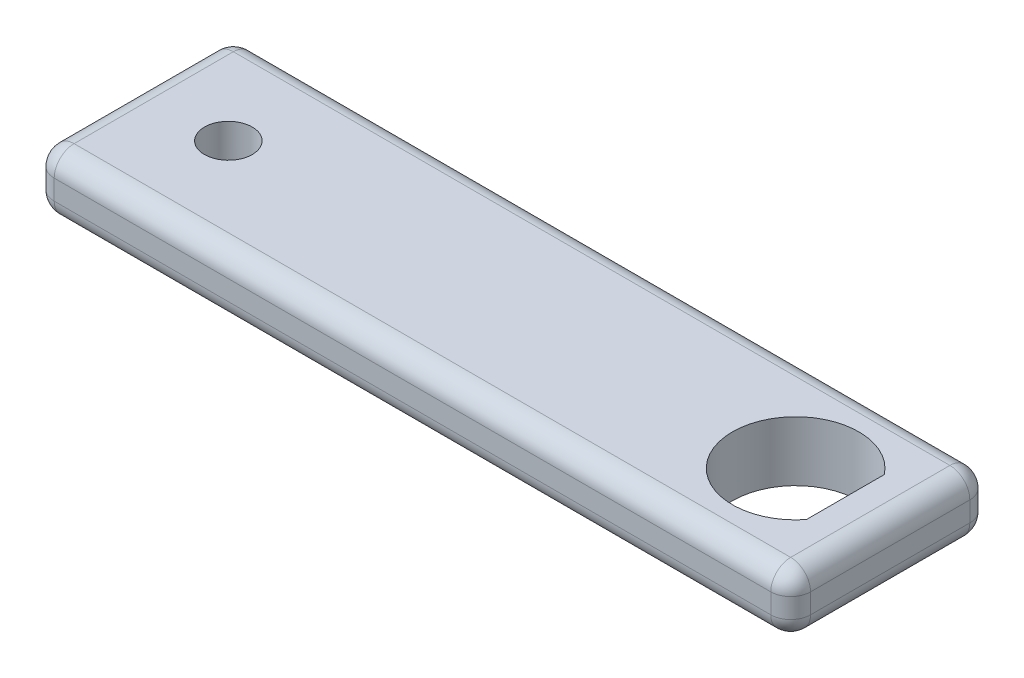
ISO-10303-21;
HEADER;
FILE_DESCRIPTION(('STEP AP214'),'2;1');
FILE_NAME('part.step','',(''),(''),'','','');
FILE_SCHEMA(('AUTOMOTIVE_DESIGN { 1 0 10303 214 1 1 1 1 }'));
ENDSEC;
DATA;
#1=APPLICATION_CONTEXT('core data for automotive mechanical design processes');
#2=APPLICATION_PROTOCOL_DEFINITION('international standard','automotive_design',2000,#1);
#3=PRODUCT_CONTEXT('',#1,'mechanical');
#4=PRODUCT('Part','Part','',(#3));
#5=PRODUCT_RELATED_PRODUCT_CATEGORY('part','',(#4));
#6=PRODUCT_DEFINITION_FORMATION('','',#4);
#7=PRODUCT_DEFINITION_CONTEXT('part definition',#1,'design');
#8=PRODUCT_DEFINITION('design','',#6,#7);
#9=PRODUCT_DEFINITION_SHAPE('','',#8);
#10=(LENGTH_UNIT() NAMED_UNIT(*) SI_UNIT(.MILLI.,.METRE.));
#11=(NAMED_UNIT(*) PLANE_ANGLE_UNIT() SI_UNIT($,.RADIAN.));
#12=(NAMED_UNIT(*) SI_UNIT($,.STERADIAN.) SOLID_ANGLE_UNIT());
#13=UNCERTAINTY_MEASURE_WITH_UNIT(LENGTH_MEASURE(1.E-05),#10,'distance_accuracy_value','');
#14=(GEOMETRIC_REPRESENTATION_CONTEXT(3) GLOBAL_UNCERTAINTY_ASSIGNED_CONTEXT((#13)) GLOBAL_UNIT_ASSIGNED_CONTEXT((#10,
#11,#12)) REPRESENTATION_CONTEXT('',''));
#15=CARTESIAN_POINT('',(0.,0.,0.));
#16=DIRECTION('',(0.,0.,1.));
#17=DIRECTION('',(1.,0.,0.));
#18=AXIS2_PLACEMENT_3D('',#15,#16,#17);
#19=CARTESIAN_POINT('',(0.,6.,0.));
#20=DIRECTION('',(1.,0.,0.));
#21=DIRECTION('',(0.,0.,-1.));
#22=AXIS2_PLACEMENT_3D('',#19,#20,#21);
#23=PLANE('',#22);
#24=DIRECTION('',(0.,-1.,0.));
#25=VECTOR('',#24,1.);
#26=CARTESIAN_POINT('',(0.,6.,-18.));
#27=LINE('',#26,#25);
#28=CARTESIAN_POINT('',(0.,4.,-18.));
#29=VERTEX_POINT('',#28);
#30=CARTESIAN_POINT('',(0.,2.,-18.));
#31=VERTEX_POINT('',#30);
#32=EDGE_CURVE('E172',#29,#31,#27,.T.);
#33=ORIENTED_EDGE('',*,*,#32,.T.);
#34=DIRECTION('',(0.,0.,1.));
#35=VECTOR('',#34,1.);
#36=CARTESIAN_POINT('',(0.,2.,0.));
#37=LINE('',#36,#35);
#38=CARTESIAN_POINT('',(0.,2.,-2.));
#39=VERTEX_POINT('',#38);
#40=EDGE_CURVE('E175',#31,#39,#37,.T.);
#41=ORIENTED_EDGE('',*,*,#40,.T.);
#42=DIRECTION('',(0.,-1.,0.));
#43=VECTOR('',#42,1.);
#44=CARTESIAN_POINT('',(0.,6.,-2.));
#45=LINE('',#44,#43);
#46=CARTESIAN_POINT('',(0.,4.,-2.));
#47=VERTEX_POINT('',#46);
#48=EDGE_CURVE('E170',#39,#47,#45,.F.);
#49=ORIENTED_EDGE('',*,*,#48,.T.);
#50=DIRECTION('',(0.,0.,1.));
#51=VECTOR('',#50,1.);
#52=CARTESIAN_POINT('',(0.,4.,0.));
#53=LINE('',#52,#51);
#54=EDGE_CURVE('E168',#47,#29,#53,.F.);
#55=ORIENTED_EDGE('',*,*,#54,.T.);
#56=EDGE_LOOP('',(#33,#41,#49,#55));
#57=FACE_BOUND('',#56,.T.);
#58=ADVANCED_FACE('F33',(#57),#23,.F.);
#59=CARTESIAN_POINT('',(0.,6.,0.));
#60=DIRECTION('',(0.,0.,-1.));
#61=DIRECTION('',(-1.,0.,0.));
#62=AXIS2_PLACEMENT_3D('',#59,#60,#61);
#63=PLANE('',#62);
#64=DIRECTION('',(0.,-1.,0.));
#65=VECTOR('',#64,1.);
#66=CARTESIAN_POINT('',(2.,6.,0.));
#67=LINE('',#66,#65);
#68=CARTESIAN_POINT('',(2.,4.,0.));
#69=VERTEX_POINT('',#68);
#70=CARTESIAN_POINT('',(2.,2.,0.));
#71=VERTEX_POINT('',#70);
#72=EDGE_CURVE('E190',#69,#71,#67,.T.);
#73=ORIENTED_EDGE('',*,*,#72,.T.);
#74=DIRECTION('',(1.,0.,0.));
#75=VECTOR('',#74,1.);
#76=CARTESIAN_POINT('',(76.,2.,0.));
#77=LINE('',#76,#75);
#78=CARTESIAN_POINT('',(74.,2.,0.));
#79=VERTEX_POINT('',#78);
#80=EDGE_CURVE('E193',#71,#79,#77,.T.);
#81=ORIENTED_EDGE('',*,*,#80,.T.);
#82=DIRECTION('',(0.,-1.,0.));
#83=VECTOR('',#82,1.);
#84=CARTESIAN_POINT('',(74.,6.,0.));
#85=LINE('',#84,#83);
#86=CARTESIAN_POINT('',(74.,4.,0.));
#87=VERTEX_POINT('',#86);
#88=EDGE_CURVE('E188',#79,#87,#85,.F.);
#89=ORIENTED_EDGE('',*,*,#88,.T.);
#90=DIRECTION('',(1.,0.,0.));
#91=VECTOR('',#90,1.);
#92=CARTESIAN_POINT('',(0.,4.,0.));
#93=LINE('',#92,#91);
#94=EDGE_CURVE('E186',#87,#69,#93,.F.);
#95=ORIENTED_EDGE('',*,*,#94,.T.);
#96=EDGE_LOOP('',(#73,#81,#89,#95));
#97=FACE_BOUND('',#96,.T.);
#98=ADVANCED_FACE('F305',(#97),#63,.F.);
#99=CARTESIAN_POINT('',(76.,6.,0.));
#100=DIRECTION('',(-1.,0.,0.));
#101=DIRECTION('',(0.,0.,1.));
#102=AXIS2_PLACEMENT_3D('',#99,#100,#101);
#103=PLANE('',#102);
#104=DIRECTION('',(0.,-1.,0.));
#105=VECTOR('',#104,1.);
#106=CARTESIAN_POINT('',(76.,6.,-2.));
#107=LINE('',#106,#105);
#108=CARTESIAN_POINT('',(76.,4.,-2.));
#109=VERTEX_POINT('',#108);
#110=CARTESIAN_POINT('',(76.,2.,-2.));
#111=VERTEX_POINT('',#110);
#112=EDGE_CURVE('E197',#109,#111,#107,.T.);
#113=ORIENTED_EDGE('',*,*,#112,.T.);
#114=DIRECTION('',(0.,0.,-1.));
#115=VECTOR('',#114,1.);
#116=CARTESIAN_POINT('',(76.,2.,-20.));
#117=LINE('',#116,#115);
#118=CARTESIAN_POINT('',(76.,2.,-18.));
#119=VERTEX_POINT('',#118);
#120=EDGE_CURVE('E202',#111,#119,#117,.T.);
#121=ORIENTED_EDGE('',*,*,#120,.T.);
#122=DIRECTION('',(0.,-1.,0.));
#123=VECTOR('',#122,1.);
#124=CARTESIAN_POINT('',(76.,6.,-18.));
#125=LINE('',#124,#123);
#126=CARTESIAN_POINT('',(76.,4.,-18.));
#127=VERTEX_POINT('',#126);
#128=EDGE_CURVE('E199',#119,#127,#125,.F.);
#129=ORIENTED_EDGE('',*,*,#128,.T.);
#130=DIRECTION('',(0.,0.,-1.));
#131=VECTOR('',#130,1.);
#132=CARTESIAN_POINT('',(76.,4.,0.));
#133=LINE('',#132,#131);
#134=EDGE_CURVE('E195',#127,#109,#133,.F.);
#135=ORIENTED_EDGE('',*,*,#134,.T.);
#136=EDGE_LOOP('',(#113,#121,#129,#135));
#137=FACE_BOUND('',#136,.T.);
#138=ADVANCED_FACE('F311',(#137),#103,.F.);
#139=CARTESIAN_POINT('',(0.,6.,-20.));
#140=DIRECTION('',(0.,0.,1.));
#141=DIRECTION('',(1.,0.,0.));
#142=AXIS2_PLACEMENT_3D('',#139,#140,#141);
#143=PLANE('',#142);
#144=DIRECTION('',(0.,-1.,0.));
#145=VECTOR('',#144,1.);
#146=CARTESIAN_POINT('',(74.,6.,-20.));
#147=LINE('',#146,#145);
#148=CARTESIAN_POINT('',(74.,4.,-20.));
#149=VERTEX_POINT('',#148);
#150=CARTESIAN_POINT('',(74.,2.,-20.));
#151=VERTEX_POINT('',#150);
#152=EDGE_CURVE('E179',#149,#151,#147,.T.);
#153=ORIENTED_EDGE('',*,*,#152,.T.);
#154=DIRECTION('',(-1.,0.,0.));
#155=VECTOR('',#154,1.);
#156=CARTESIAN_POINT('',(0.,2.,-20.));
#157=LINE('',#156,#155);
#158=CARTESIAN_POINT('',(2.,2.,-20.));
#159=VERTEX_POINT('',#158);
#160=EDGE_CURVE('E184',#151,#159,#157,.T.);
#161=ORIENTED_EDGE('',*,*,#160,.T.);
#162=DIRECTION('',(0.,-1.,0.));
#163=VECTOR('',#162,1.);
#164=CARTESIAN_POINT('',(2.,6.,-20.));
#165=LINE('',#164,#163);
#166=CARTESIAN_POINT('',(2.,4.,-20.));
#167=VERTEX_POINT('',#166);
#168=EDGE_CURVE('E181',#159,#167,#165,.F.);
#169=ORIENTED_EDGE('',*,*,#168,.T.);
#170=DIRECTION('',(-1.,0.,0.));
#171=VECTOR('',#170,1.);
#172=CARTESIAN_POINT('',(0.,4.,-20.));
#173=LINE('',#172,#171);
#174=EDGE_CURVE('E177',#167,#149,#173,.F.);
#175=ORIENTED_EDGE('',*,*,#174,.T.);
#176=EDGE_LOOP('',(#153,#161,#169,#175));
#177=FACE_BOUND('',#176,.T.);
#178=ADVANCED_FACE('F289',(#177),#143,.F.);
#179=CARTESIAN_POINT('',(0.,6.,0.));
#180=DIRECTION('',(0.,-1.,0.));
#181=DIRECTION('',(0.,0.,-1.));
#182=AXIS2_PLACEMENT_3D('',#179,#180,#181);
#183=PLANE('',#182);
#184=DIRECTION('',(-1.,0.,0.));
#185=VECTOR('',#184,1.);
#186=CARTESIAN_POINT('',(0.,6.,-18.));
#187=LINE('',#186,#185);
#188=CARTESIAN_POINT('',(74.,6.,-18.));
#189=VERTEX_POINT('',#188);
#190=CARTESIAN_POINT('',(2.,6.,-18.));
#191=VERTEX_POINT('',#190);
#192=EDGE_CURVE('E213',#189,#191,#187,.T.);
#193=ORIENTED_EDGE('',*,*,#192,.T.);
#194=DIRECTION('',(0.,0.,1.));
#195=VECTOR('',#194,1.);
#196=CARTESIAN_POINT('',(2.,6.,0.));
#197=LINE('',#196,#195);
#198=CARTESIAN_POINT('',(2.,6.,-2.));
#199=VERTEX_POINT('',#198);
#200=EDGE_CURVE('E11',#191,#199,#197,.T.);
#201=ORIENTED_EDGE('',*,*,#200,.T.);
#202=DIRECTION('',(1.,0.,0.));
#203=VECTOR('',#202,1.);
#204=CARTESIAN_POINT('',(0.,6.,-2.));
#205=LINE('',#204,#203);
#206=CARTESIAN_POINT('',(74.,6.,-2.));
#207=VERTEX_POINT('',#206);
#208=EDGE_CURVE('E42',#199,#207,#205,.T.);
#209=ORIENTED_EDGE('',*,*,#208,.T.);
#210=DIRECTION('',(0.,0.,-1.));
#211=VECTOR('',#210,1.);
#212=CARTESIAN_POINT('',(74.,6.,0.));
#213=LINE('',#212,#211);
#214=EDGE_CURVE('E215',#207,#189,#213,.T.);
#215=ORIENTED_EDGE('',*,*,#214,.T.);
#216=EDGE_LOOP('',(#193,#201,#209,#215));
#217=FACE_BOUND('',#216,.T.);
#218=CARTESIAN_POINT('',(66.5,6.,-10.));
#219=DIRECTION('',(0.,1.,0.));
#220=DIRECTION('',(0.,0.,1.));
#221=AXIS2_PLACEMENT_3D('',#218,#219,#220);
#222=CIRCLE('',#221,6.35);
#223=CARTESIAN_POINT('',(71.5,6.,-13.91439650521));
#224=VERTEX_POINT('',#223);
#225=CARTESIAN_POINT('',(71.5,6.,-6.08560349479005));
#226=VERTEX_POINT('',#225);
#227=EDGE_CURVE('E157',#224,#226,#222,.T.);
#228=ORIENTED_EDGE('',*,*,#227,.F.);
#229=DIRECTION('',(0.,0.,-1.));
#230=VECTOR('',#229,1.);
#231=CARTESIAN_POINT('',(71.5,6.,-13.91439650521));
#232=LINE('',#231,#230);
#233=EDGE_CURVE('E152',#226,#224,#232,.T.);
#234=ORIENTED_EDGE('',*,*,#233,.F.);
#235=EDGE_LOOP('',(#228,#234));
#236=FACE_BOUND('',#235,.T.);
#237=CARTESIAN_POINT('',(9.5,6.,-10.));
#238=DIRECTION('',(0.,1.,0.));
#239=DIRECTION('',(0.,0.,1.));
#240=AXIS2_PLACEMENT_3D('',#237,#238,#239);
#241=CIRCLE('',#240,2.4);
#242=CARTESIAN_POINT('',(9.5,6.,-7.6));
#243=VERTEX_POINT('',#242);
#244=EDGE_CURVE('E162',#243,#243,#241,.T.);
#245=ORIENTED_EDGE('',*,*,#244,.F.);
#246=EDGE_LOOP('',(#245));
#247=FACE_BOUND('',#246,.T.);
#248=ADVANCED_FACE('F286',(#217,#236,#247),#183,.F.);
#249=CARTESIAN_POINT('',(0.,0.,0.));
#250=DIRECTION('',(0.,-1.,0.));
#251=DIRECTION('',(0.,0.,-1.));
#252=AXIS2_PLACEMENT_3D('',#249,#250,#251);
#253=PLANE('',#252);
#254=DIRECTION('',(1.,0.,0.));
#255=VECTOR('',#254,1.);
#256=CARTESIAN_POINT('',(0.,0.,-2.));
#257=LINE('',#256,#255);
#258=CARTESIAN_POINT('',(74.,0.,-2.));
#259=VERTEX_POINT('',#258);
#260=CARTESIAN_POINT('',(2.,0.,-2.));
#261=VERTEX_POINT('',#260);
#262=EDGE_CURVE('E204',#259,#261,#257,.F.);
#263=ORIENTED_EDGE('',*,*,#262,.T.);
#264=DIRECTION('',(0.,0.,1.));
#265=VECTOR('',#264,1.);
#266=CARTESIAN_POINT('',(2.,0.,-20.));
#267=LINE('',#266,#265);
#268=CARTESIAN_POINT('',(2.,0.,-18.));
#269=VERTEX_POINT('',#268);
#270=EDGE_CURVE('E210',#261,#269,#267,.F.);
#271=ORIENTED_EDGE('',*,*,#270,.T.);
#272=DIRECTION('',(-1.,0.,0.));
#273=VECTOR('',#272,1.);
#274=CARTESIAN_POINT('',(76.,0.,-18.));
#275=LINE('',#274,#273);
#276=CARTESIAN_POINT('',(74.,0.,-18.));
#277=VERTEX_POINT('',#276);
#278=EDGE_CURVE('E208',#269,#277,#275,.F.);
#279=ORIENTED_EDGE('',*,*,#278,.T.);
#280=DIRECTION('',(0.,0.,-1.));
#281=VECTOR('',#280,1.);
#282=CARTESIAN_POINT('',(74.,0.,0.));
#283=LINE('',#282,#281);
#284=EDGE_CURVE('E206',#277,#259,#283,.F.);
#285=ORIENTED_EDGE('',*,*,#284,.T.);
#286=EDGE_LOOP('',(#263,#271,#279,#285));
#287=FACE_BOUND('',#286,.T.);
#288=DIRECTION('',(0.,0.,-1.));
#289=VECTOR('',#288,1.);
#290=CARTESIAN_POINT('',(71.5,0.,-13.91439650521));
#291=LINE('',#290,#289);
#292=CARTESIAN_POINT('',(71.5,0.,-6.08560349479005));
#293=VERTEX_POINT('',#292);
#294=CARTESIAN_POINT('',(71.5,0.,-13.91439650521));
#295=VERTEX_POINT('',#294);
#296=EDGE_CURVE('E150',#293,#295,#291,.T.);
#297=ORIENTED_EDGE('',*,*,#296,.T.);
#298=CARTESIAN_POINT('',(66.5,0.,-10.));
#299=DIRECTION('',(0.,-1.,0.));
#300=DIRECTION('',(0.,0.,-1.));
#301=AXIS2_PLACEMENT_3D('',#298,#299,#300);
#302=CIRCLE('',#301,6.35);
#303=EDGE_CURVE('E137',#295,#293,#302,.F.);
#304=ORIENTED_EDGE('',*,*,#303,.T.);
#305=EDGE_LOOP('',(#297,#304));
#306=FACE_BOUND('',#305,.T.);
#307=CARTESIAN_POINT('',(9.5,0.,-10.));
#308=DIRECTION('',(0.,-1.,0.));
#309=DIRECTION('',(0.,0.,-1.));
#310=AXIS2_PLACEMENT_3D('',#307,#308,#309);
#311=CIRCLE('',#310,2.4);
#312=CARTESIAN_POINT('',(9.5,0.,-12.4));
#313=VERTEX_POINT('',#312);
#314=EDGE_CURVE('E165',#313,#313,#311,.F.);
#315=ORIENTED_EDGE('',*,*,#314,.T.);
#316=EDGE_LOOP('',(#315));
#317=FACE_BOUND('',#316,.T.);
#318=ADVANCED_FACE('F154',(#287,#306,#317),#253,.T.);
#319=CARTESIAN_POINT('',(9.5,-17.0326891593782,-10.));
#320=DIRECTION('',(0.,1.,0.));
#321=DIRECTION('',(0.,0.,1.));
#322=AXIS2_PLACEMENT_3D('',#319,#320,#321);
#323=CYLINDRICAL_SURFACE('',#322,2.4);
#324=ORIENTED_EDGE('',*,*,#244,.T.);
#325=EDGE_LOOP('',(#324));
#326=FACE_BOUND('',#325,.T.);
#327=ORIENTED_EDGE('',*,*,#314,.F.);
#328=EDGE_LOOP('',(#327));
#329=FACE_BOUND('',#328,.T.);
#330=ADVANCED_FACE('F293',(#326,#329),#323,.F.);
#331=CARTESIAN_POINT('',(71.5,-17.0326891593782,-13.91439650521));
#332=DIRECTION('',(1.,0.,0.));
#333=DIRECTION('',(0.,0.,-1.));
#334=AXIS2_PLACEMENT_3D('',#331,#332,#333);
#335=PLANE('',#334);
#336=DIRECTION('',(0.,1.,0.));
#337=VECTOR('',#336,1.);
#338=CARTESIAN_POINT('',(71.5,-17.0326891593782,-6.08560349479005));
#339=LINE('',#338,#337);
#340=EDGE_CURVE('E143',#293,#226,#339,.T.);
#341=ORIENTED_EDGE('',*,*,#340,.T.);
#342=ORIENTED_EDGE('',*,*,#233,.T.);
#343=DIRECTION('',(0.,1.,0.));
#344=VECTOR('',#343,1.);
#345=CARTESIAN_POINT('',(71.5,-17.0326891593782,-13.91439650521));
#346=LINE('',#345,#344);
#347=EDGE_CURVE('E141',#295,#224,#346,.T.);
#348=ORIENTED_EDGE('',*,*,#347,.F.);
#349=ORIENTED_EDGE('',*,*,#296,.F.);
#350=EDGE_LOOP('',(#341,#342,#348,#349));
#351=FACE_BOUND('',#350,.T.);
#352=ADVANCED_FACE('F149',(#351),#335,.F.);
#353=CARTESIAN_POINT('',(66.5,-17.0326891593782,-10.));
#354=DIRECTION('',(0.,1.,0.));
#355=DIRECTION('',(0.,0.,1.));
#356=AXIS2_PLACEMENT_3D('',#353,#354,#355);
#357=CYLINDRICAL_SURFACE('',#356,6.35);
#358=ORIENTED_EDGE('',*,*,#347,.T.);
#359=ORIENTED_EDGE('',*,*,#227,.T.);
#360=ORIENTED_EDGE('',*,*,#340,.F.);
#361=ORIENTED_EDGE('',*,*,#303,.F.);
#362=EDGE_LOOP('',(#358,#359,#360,#361));
#363=FACE_BOUND('',#362,.T.);
#364=ADVANCED_FACE('F139',(#363),#357,.F.);
#365=CARTESIAN_POINT('',(74.,6.,-2.));
#366=DIRECTION('',(0.,-1.,0.));
#367=DIRECTION('',(0.,0.,-1.));
#368=AXIS2_PLACEMENT_3D('',#365,#366,#367);
#369=CYLINDRICAL_SURFACE('',#368,2.);
#370=CARTESIAN_POINT('',(74.,4.,-2.));
#371=DIRECTION('',(0.,1.,0.));
#372=DIRECTION('',(0.,0.,1.));
#373=AXIS2_PLACEMENT_3D('',#370,#371,#372);
#374=CIRCLE('',#373,2.);
#375=EDGE_CURVE('E37',#87,#109,#374,.T.);
#376=ORIENTED_EDGE('',*,*,#375,.F.);
#377=ORIENTED_EDGE('',*,*,#88,.F.);
#378=CARTESIAN_POINT('',(74.,2.,-2.));
#379=DIRECTION('',(0.,-1.,0.));
#380=DIRECTION('',(0.,0.,-1.));
#381=AXIS2_PLACEMENT_3D('',#378,#379,#380);
#382=CIRCLE('',#381,2.);
#383=EDGE_CURVE('E274',#111,#79,#382,.T.);
#384=ORIENTED_EDGE('',*,*,#383,.F.);
#385=ORIENTED_EDGE('',*,*,#112,.F.);
#386=EDGE_LOOP('',(#376,#377,#384,#385));
#387=FACE_BOUND('',#386,.T.);
#388=ADVANCED_FACE('F35',(#387),#369,.T.);
#389=CARTESIAN_POINT('',(74.,4.,-2.));
#390=DIRECTION('',(0.,0.,1.));
#391=DIRECTION('',(1.,0.,0.));
#392=AXIS2_PLACEMENT_3D('',#389,#390,#391);
#393=SPHERICAL_SURFACE('',#392,2.);
#394=CARTESIAN_POINT('',(74.,4.,-2.));
#395=DIRECTION('',(1.,0.,0.));
#396=DIRECTION('',(0.,0.,-1.));
#397=AXIS2_PLACEMENT_3D('',#394,#395,#396);
#398=CIRCLE('',#397,2.);
#399=EDGE_CURVE('E270',#87,#207,#398,.F.);
#400=ORIENTED_EDGE('',*,*,#399,.F.);
#401=ORIENTED_EDGE('',*,*,#375,.T.);
#402=CARTESIAN_POINT('',(74.,4.,-2.));
#403=DIRECTION('',(0.,0.,1.));
#404=DIRECTION('',(1.,0.,0.));
#405=AXIS2_PLACEMENT_3D('',#402,#403,#404);
#406=CIRCLE('',#405,2.);
#407=EDGE_CURVE('E272',#207,#109,#406,.F.);
#408=ORIENTED_EDGE('',*,*,#407,.F.);
#409=EDGE_LOOP('',(#400,#401,#408));
#410=FACE_BOUND('',#409,.T.);
#411=ADVANCED_FACE('F385',(#410),#393,.T.);
#412=CARTESIAN_POINT('',(74.,2.,-2.));
#413=DIRECTION('',(0.,0.,1.));
#414=DIRECTION('',(1.,0.,0.));
#415=AXIS2_PLACEMENT_3D('',#412,#413,#414);
#416=SPHERICAL_SURFACE('',#415,2.);
#417=CARTESIAN_POINT('',(74.,2.,-2.));
#418=DIRECTION('',(0.,0.,1.));
#419=DIRECTION('',(1.,0.,0.));
#420=AXIS2_PLACEMENT_3D('',#417,#418,#419);
#421=CIRCLE('',#420,2.);
#422=EDGE_CURVE('E264',#111,#259,#421,.F.);
#423=ORIENTED_EDGE('',*,*,#422,.F.);
#424=ORIENTED_EDGE('',*,*,#383,.T.);
#425=CARTESIAN_POINT('',(74.,2.,-2.));
#426=DIRECTION('',(1.,0.,0.));
#427=DIRECTION('',(0.,0.,-1.));
#428=AXIS2_PLACEMENT_3D('',#425,#426,#427);
#429=CIRCLE('',#428,2.);
#430=EDGE_CURVE('E267',#259,#79,#429,.F.);
#431=ORIENTED_EDGE('',*,*,#430,.F.);
#432=EDGE_LOOP('',(#423,#424,#431));
#433=FACE_BOUND('',#432,.T.);
#434=ADVANCED_FACE('F382',(#433),#416,.T.);
#435=CARTESIAN_POINT('',(74.,4.,0.));
#436=DIRECTION('',(0.,0.,-1.));
#437=DIRECTION('',(-1.,0.,0.));
#438=AXIS2_PLACEMENT_3D('',#435,#436,#437);
#439=CYLINDRICAL_SURFACE('',#438,2.);
#440=ORIENTED_EDGE('',*,*,#407,.T.);
#441=ORIENTED_EDGE('',*,*,#134,.F.);
#442=CARTESIAN_POINT('',(74.,4.,-18.));
#443=DIRECTION('',(0.,0.,-1.));
#444=DIRECTION('',(-1.,0.,0.));
#445=AXIS2_PLACEMENT_3D('',#442,#443,#444);
#446=CIRCLE('',#445,2.);
#447=EDGE_CURVE('E259',#189,#127,#446,.T.);
#448=ORIENTED_EDGE('',*,*,#447,.F.);
#449=ORIENTED_EDGE('',*,*,#214,.F.);
#450=EDGE_LOOP('',(#440,#441,#448,#449));
#451=FACE_BOUND('',#450,.T.);
#452=ADVANCED_FACE('F378',(#451),#439,.T.);
#453=CARTESIAN_POINT('',(0.,4.,-2.));
#454=DIRECTION('',(1.,0.,0.));
#455=DIRECTION('',(0.,0.,-1.));
#456=AXIS2_PLACEMENT_3D('',#453,#454,#455);
#457=CYLINDRICAL_SURFACE('',#456,2.);
#458=ORIENTED_EDGE('',*,*,#399,.T.);
#459=ORIENTED_EDGE('',*,*,#208,.F.);
#460=CARTESIAN_POINT('',(2.,4.,-2.));
#461=DIRECTION('',(-1.,0.,0.));
#462=DIRECTION('',(0.,0.,1.));
#463=AXIS2_PLACEMENT_3D('',#460,#461,#462);
#464=CIRCLE('',#463,2.);
#465=EDGE_CURVE('E257',#69,#199,#464,.T.);
#466=ORIENTED_EDGE('',*,*,#465,.F.);
#467=ORIENTED_EDGE('',*,*,#94,.F.);
#468=EDGE_LOOP('',(#458,#459,#466,#467));
#469=FACE_BOUND('',#468,.T.);
#470=ADVANCED_FACE('F374',(#469),#457,.T.);
#471=CARTESIAN_POINT('',(2.,6.,-2.));
#472=DIRECTION('',(0.,-1.,0.));
#473=DIRECTION('',(0.,0.,-1.));
#474=AXIS2_PLACEMENT_3D('',#471,#472,#473);
#475=CYLINDRICAL_SURFACE('',#474,2.);
#476=CARTESIAN_POINT('',(2.,2.,-2.));
#477=DIRECTION('',(0.,-1.,0.));
#478=DIRECTION('',(0.,0.,-1.));
#479=AXIS2_PLACEMENT_3D('',#476,#477,#478);
#480=CIRCLE('',#479,2.);
#481=EDGE_CURVE('E251',#71,#39,#480,.T.);
#482=ORIENTED_EDGE('',*,*,#481,.F.);
#483=ORIENTED_EDGE('',*,*,#72,.F.);
#484=CARTESIAN_POINT('',(2.,4.,-2.));
#485=DIRECTION('',(0.,1.,0.));
#486=DIRECTION('',(0.,0.,1.));
#487=AXIS2_PLACEMENT_3D('',#484,#485,#486);
#488=CIRCLE('',#487,2.);
#489=EDGE_CURVE('E254',#47,#69,#488,.T.);
#490=ORIENTED_EDGE('',*,*,#489,.F.);
#491=ORIENTED_EDGE('',*,*,#48,.F.);
#492=EDGE_LOOP('',(#482,#483,#490,#491));
#493=FACE_BOUND('',#492,.T.);
#494=ADVANCED_FACE('F370',(#493),#475,.T.);
#495=CARTESIAN_POINT('',(0.,2.,-2.));
#496=DIRECTION('',(-1.,0.,0.));
#497=DIRECTION('',(0.,0.,1.));
#498=AXIS2_PLACEMENT_3D('',#495,#496,#497);
#499=CYLINDRICAL_SURFACE('',#498,2.);
#500=ORIENTED_EDGE('',*,*,#430,.T.);
#501=ORIENTED_EDGE('',*,*,#80,.F.);
#502=CARTESIAN_POINT('',(2.,2.,-2.));
#503=DIRECTION('',(-1.,0.,0.));
#504=DIRECTION('',(0.,0.,1.));
#505=AXIS2_PLACEMENT_3D('',#502,#503,#504);
#506=CIRCLE('',#505,2.);
#507=EDGE_CURVE('E249',#261,#71,#506,.T.);
#508=ORIENTED_EDGE('',*,*,#507,.F.);
#509=ORIENTED_EDGE('',*,*,#262,.F.);
#510=EDGE_LOOP('',(#500,#501,#508,#509));
#511=FACE_BOUND('',#510,.T.);
#512=ADVANCED_FACE('F366',(#511),#499,.T.);
#513=CARTESIAN_POINT('',(74.,2.,0.));
#514=DIRECTION('',(0.,0.,1.));
#515=DIRECTION('',(1.,0.,0.));
#516=AXIS2_PLACEMENT_3D('',#513,#514,#515);
#517=CYLINDRICAL_SURFACE('',#516,2.);
#518=ORIENTED_EDGE('',*,*,#422,.T.);
#519=ORIENTED_EDGE('',*,*,#284,.F.);
#520=CARTESIAN_POINT('',(74.,2.,-18.));
#521=DIRECTION('',(0.,0.,-1.));
#522=DIRECTION('',(-1.,0.,0.));
#523=AXIS2_PLACEMENT_3D('',#520,#521,#522);
#524=CIRCLE('',#523,2.);
#525=EDGE_CURVE('E246',#119,#277,#524,.T.);
#526=ORIENTED_EDGE('',*,*,#525,.F.);
#527=ORIENTED_EDGE('',*,*,#120,.F.);
#528=EDGE_LOOP('',(#518,#519,#526,#527));
#529=FACE_BOUND('',#528,.T.);
#530=ADVANCED_FACE('F362',(#529),#517,.T.);
#531=CARTESIAN_POINT('',(74.,6.,-18.));
#532=DIRECTION('',(0.,-1.,0.));
#533=DIRECTION('',(0.,0.,-1.));
#534=AXIS2_PLACEMENT_3D('',#531,#532,#533);
#535=CYLINDRICAL_SURFACE('',#534,2.);
#536=CARTESIAN_POINT('',(74.,4.,-18.));
#537=DIRECTION('',(0.,1.,0.));
#538=DIRECTION('',(0.,0.,1.));
#539=AXIS2_PLACEMENT_3D('',#536,#537,#538);
#540=CIRCLE('',#539,2.);
#541=EDGE_CURVE('E261',#127,#149,#540,.T.);
#542=ORIENTED_EDGE('',*,*,#541,.F.);
#543=ORIENTED_EDGE('',*,*,#128,.F.);
#544=CARTESIAN_POINT('',(74.,2.,-18.));
#545=DIRECTION('',(0.,-1.,0.));
#546=DIRECTION('',(0.,0.,-1.));
#547=AXIS2_PLACEMENT_3D('',#544,#545,#546);
#548=CIRCLE('',#547,2.);
#549=EDGE_CURVE('E243',#151,#119,#548,.T.);
#550=ORIENTED_EDGE('',*,*,#549,.F.);
#551=ORIENTED_EDGE('',*,*,#152,.F.);
#552=EDGE_LOOP('',(#542,#543,#550,#551));
#553=FACE_BOUND('',#552,.T.);
#554=ADVANCED_FACE('F358',(#553),#535,.T.);
#555=CARTESIAN_POINT('',(74.,4.,-18.));
#556=DIRECTION('',(0.,0.,1.));
#557=DIRECTION('',(1.,0.,0.));
#558=AXIS2_PLACEMENT_3D('',#555,#556,#557);
#559=SPHERICAL_SURFACE('',#558,2.);
#560=ORIENTED_EDGE('',*,*,#447,.T.);
#561=ORIENTED_EDGE('',*,*,#541,.T.);
#562=CARTESIAN_POINT('',(74.,4.,-18.));
#563=DIRECTION('',(1.,0.,0.));
#564=DIRECTION('',(0.,0.,-1.));
#565=AXIS2_PLACEMENT_3D('',#562,#563,#564);
#566=CIRCLE('',#565,2.);
#567=EDGE_CURVE('E240',#189,#149,#566,.F.);
#568=ORIENTED_EDGE('',*,*,#567,.F.);
#569=EDGE_LOOP('',(#560,#561,#568));
#570=FACE_BOUND('',#569,.T.);
#571=ADVANCED_FACE('F354',(#570),#559,.T.);
#572=CARTESIAN_POINT('',(2.,4.,-2.));
#573=DIRECTION('',(0.,0.,1.));
#574=DIRECTION('',(1.,0.,0.));
#575=AXIS2_PLACEMENT_3D('',#572,#573,#574);
#576=SPHERICAL_SURFACE('',#575,2.);
#577=ORIENTED_EDGE('',*,*,#489,.T.);
#578=ORIENTED_EDGE('',*,*,#465,.T.);
#579=CARTESIAN_POINT('',(2.,4.,-2.));
#580=DIRECTION('',(0.,0.,1.));
#581=DIRECTION('',(1.,0.,0.));
#582=AXIS2_PLACEMENT_3D('',#579,#580,#581);
#583=CIRCLE('',#582,2.);
#584=EDGE_CURVE('E50',#47,#199,#583,.F.);
#585=ORIENTED_EDGE('',*,*,#584,.F.);
#586=EDGE_LOOP('',(#577,#578,#585));
#587=FACE_BOUND('',#586,.T.);
#588=ADVANCED_FACE('F350',(#587),#576,.T.);
#589=CARTESIAN_POINT('',(2.,2.,-2.));
#590=DIRECTION('',(0.,0.,1.));
#591=DIRECTION('',(1.,0.,0.));
#592=AXIS2_PLACEMENT_3D('',#589,#590,#591);
#593=SPHERICAL_SURFACE('',#592,2.);
#594=ORIENTED_EDGE('',*,*,#507,.T.);
#595=ORIENTED_EDGE('',*,*,#481,.T.);
#596=CARTESIAN_POINT('',(2.,2.,-2.));
#597=DIRECTION('',(0.,0.,1.));
#598=DIRECTION('',(1.,0.,0.));
#599=AXIS2_PLACEMENT_3D('',#596,#597,#598);
#600=CIRCLE('',#599,2.);
#601=EDGE_CURVE('E236',#261,#39,#600,.F.);
#602=ORIENTED_EDGE('',*,*,#601,.F.);
#603=EDGE_LOOP('',(#594,#595,#602));
#604=FACE_BOUND('',#603,.T.);
#605=ADVANCED_FACE('F346',(#604),#593,.T.);
#606=CARTESIAN_POINT('',(74.,2.,-18.));
#607=DIRECTION('',(0.,0.,1.));
#608=DIRECTION('',(1.,0.,0.));
#609=AXIS2_PLACEMENT_3D('',#606,#607,#608);
#610=SPHERICAL_SURFACE('',#609,2.);
#611=ORIENTED_EDGE('',*,*,#549,.T.);
#612=ORIENTED_EDGE('',*,*,#525,.T.);
#613=CARTESIAN_POINT('',(74.,2.,-18.));
#614=DIRECTION('',(1.,0.,0.));
#615=DIRECTION('',(0.,0.,-1.));
#616=AXIS2_PLACEMENT_3D('',#613,#614,#615);
#617=CIRCLE('',#616,2.);
#618=EDGE_CURVE('E233',#151,#277,#617,.F.);
#619=ORIENTED_EDGE('',*,*,#618,.F.);
#620=EDGE_LOOP('',(#611,#612,#619));
#621=FACE_BOUND('',#620,.T.);
#622=ADVANCED_FACE('F342',(#621),#610,.T.);
#623=CARTESIAN_POINT('',(0.,4.,-18.));
#624=DIRECTION('',(-1.,0.,0.));
#625=DIRECTION('',(0.,0.,1.));
#626=AXIS2_PLACEMENT_3D('',#623,#624,#625);
#627=CYLINDRICAL_SURFACE('',#626,2.);
#628=ORIENTED_EDGE('',*,*,#567,.T.);
#629=ORIENTED_EDGE('',*,*,#174,.F.);
#630=CARTESIAN_POINT('',(2.,4.,-18.));
#631=DIRECTION('',(-1.,0.,0.));
#632=DIRECTION('',(0.,0.,1.));
#633=AXIS2_PLACEMENT_3D('',#630,#631,#632);
#634=CIRCLE('',#633,2.);
#635=EDGE_CURVE('E230',#191,#167,#634,.T.);
#636=ORIENTED_EDGE('',*,*,#635,.F.);
#637=ORIENTED_EDGE('',*,*,#192,.F.);
#638=EDGE_LOOP('',(#628,#629,#636,#637));
#639=FACE_BOUND('',#638,.T.);
#640=ADVANCED_FACE('F339',(#639),#627,.T.);
#641=CARTESIAN_POINT('',(2.,4.,0.));
#642=DIRECTION('',(0.,0.,1.));
#643=DIRECTION('',(1.,0.,0.));
#644=AXIS2_PLACEMENT_3D('',#641,#642,#643);
#645=CYLINDRICAL_SURFACE('',#644,2.);
#646=ORIENTED_EDGE('',*,*,#584,.T.);
#647=ORIENTED_EDGE('',*,*,#200,.F.);
#648=CARTESIAN_POINT('',(2.,4.,-18.));
#649=DIRECTION('',(0.,0.,-1.));
#650=DIRECTION('',(-1.,0.,0.));
#651=AXIS2_PLACEMENT_3D('',#648,#649,#650);
#652=CIRCLE('',#651,2.);
#653=EDGE_CURVE('E227',#29,#191,#652,.T.);
#654=ORIENTED_EDGE('',*,*,#653,.F.);
#655=ORIENTED_EDGE('',*,*,#54,.F.);
#656=EDGE_LOOP('',(#646,#647,#654,#655));
#657=FACE_BOUND('',#656,.T.);
#658=ADVANCED_FACE('F335',(#657),#645,.T.);
#659=CARTESIAN_POINT('',(2.,2.,0.));
#660=DIRECTION('',(0.,0.,-1.));
#661=DIRECTION('',(-1.,0.,0.));
#662=AXIS2_PLACEMENT_3D('',#659,#660,#661);
#663=CYLINDRICAL_SURFACE('',#662,2.);
#664=ORIENTED_EDGE('',*,*,#601,.T.);
#665=ORIENTED_EDGE('',*,*,#40,.F.);
#666=CARTESIAN_POINT('',(2.,2.,-18.));
#667=DIRECTION('',(0.,0.,-1.));
#668=DIRECTION('',(-1.,0.,0.));
#669=AXIS2_PLACEMENT_3D('',#666,#667,#668);
#670=CIRCLE('',#669,2.);
#671=EDGE_CURVE('E224',#269,#31,#670,.T.);
#672=ORIENTED_EDGE('',*,*,#671,.F.);
#673=ORIENTED_EDGE('',*,*,#270,.F.);
#674=EDGE_LOOP('',(#664,#665,#672,#673));
#675=FACE_BOUND('',#674,.T.);
#676=ADVANCED_FACE('F331',(#675),#663,.T.);
#677=CARTESIAN_POINT('',(0.,2.,-18.));
#678=DIRECTION('',(1.,0.,0.));
#679=DIRECTION('',(0.,0.,-1.));
#680=AXIS2_PLACEMENT_3D('',#677,#678,#679);
#681=CYLINDRICAL_SURFACE('',#680,2.);
#682=ORIENTED_EDGE('',*,*,#618,.T.);
#683=ORIENTED_EDGE('',*,*,#278,.F.);
#684=CARTESIAN_POINT('',(2.,2.,-18.));
#685=DIRECTION('',(-1.,0.,0.));
#686=DIRECTION('',(0.,0.,1.));
#687=AXIS2_PLACEMENT_3D('',#684,#685,#686);
#688=CIRCLE('',#687,2.);
#689=EDGE_CURVE('E222',#159,#269,#688,.T.);
#690=ORIENTED_EDGE('',*,*,#689,.F.);
#691=ORIENTED_EDGE('',*,*,#160,.F.);
#692=EDGE_LOOP('',(#682,#683,#690,#691));
#693=FACE_BOUND('',#692,.T.);
#694=ADVANCED_FACE('F327',(#693),#681,.T.);
#695=CARTESIAN_POINT('',(2.,4.,-18.));
#696=DIRECTION('',(0.,0.,1.));
#697=DIRECTION('',(1.,0.,0.));
#698=AXIS2_PLACEMENT_3D('',#695,#696,#697);
#699=SPHERICAL_SURFACE('',#698,2.);
#700=ORIENTED_EDGE('',*,*,#653,.T.);
#701=ORIENTED_EDGE('',*,*,#635,.T.);
#702=CARTESIAN_POINT('',(2.,4.,-18.));
#703=DIRECTION('',(0.,1.,0.));
#704=DIRECTION('',(0.,0.,1.));
#705=AXIS2_PLACEMENT_3D('',#702,#703,#704);
#706=CIRCLE('',#705,2.);
#707=EDGE_CURVE('E220',#29,#167,#706,.F.);
#708=ORIENTED_EDGE('',*,*,#707,.F.);
#709=EDGE_LOOP('',(#700,#701,#708));
#710=FACE_BOUND('',#709,.T.);
#711=ADVANCED_FACE('F323',(#710),#699,.T.);
#712=CARTESIAN_POINT('',(2.,2.,-18.));
#713=DIRECTION('',(0.,0.,1.));
#714=DIRECTION('',(1.,0.,0.));
#715=AXIS2_PLACEMENT_3D('',#712,#713,#714);
#716=SPHERICAL_SURFACE('',#715,2.);
#717=ORIENTED_EDGE('',*,*,#689,.T.);
#718=ORIENTED_EDGE('',*,*,#671,.T.);
#719=CARTESIAN_POINT('',(2.,2.,-18.));
#720=DIRECTION('',(0.,-1.,0.));
#721=DIRECTION('',(0.,0.,-1.));
#722=AXIS2_PLACEMENT_3D('',#719,#720,#721);
#723=CIRCLE('',#722,2.);
#724=EDGE_CURVE('E218',#159,#31,#723,.F.);
#725=ORIENTED_EDGE('',*,*,#724,.F.);
#726=EDGE_LOOP('',(#717,#718,#725));
#727=FACE_BOUND('',#726,.T.);
#728=ADVANCED_FACE('F319',(#727),#716,.T.);
#729=CARTESIAN_POINT('',(2.,6.,-18.));
#730=DIRECTION('',(0.,-1.,0.));
#731=DIRECTION('',(0.,0.,-1.));
#732=AXIS2_PLACEMENT_3D('',#729,#730,#731);
#733=CYLINDRICAL_SURFACE('',#732,2.);
#734=ORIENTED_EDGE('',*,*,#707,.T.);
#735=ORIENTED_EDGE('',*,*,#168,.F.);
#736=ORIENTED_EDGE('',*,*,#724,.T.);
#737=ORIENTED_EDGE('',*,*,#32,.F.);
#738=EDGE_LOOP('',(#734,#735,#736,#737));
#739=FACE_BOUND('',#738,.T.);
#740=ADVANCED_FACE('F316',(#739),#733,.T.);
#741=CLOSED_SHELL('',(#58,#98,#138,#178,#248,#318,#330,#352,#364,#388,#411,#434,#452,#470,#494,
#512,#530,#554,#571,#588,#605,#622,#640,#658,#676,#694,#711,#728,#740));
#742=MANIFOLD_SOLID_BREP('B2',#741);
#743=ADVANCED_BREP_SHAPE_REPRESENTATION('',(#18,#742),#14);
#744=SHAPE_DEFINITION_REPRESENTATION(#9,#743);
ENDSEC;
END-ISO-10303-21;
